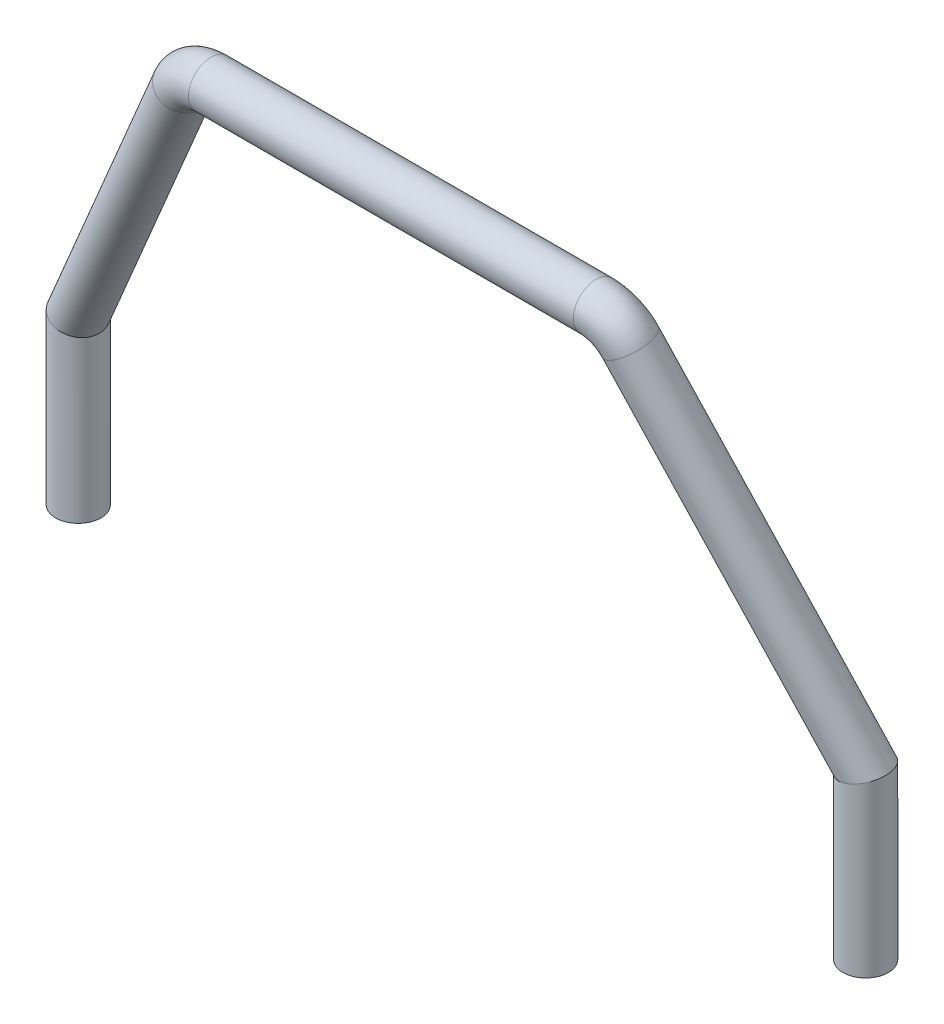
ISO-10303-21;
HEADER;
FILE_DESCRIPTION(('STEP AP214'),'2;1');
FILE_NAME('part.step','',(''),(''),'','','');
FILE_SCHEMA(('AUTOMOTIVE_DESIGN { 1 0 10303 214 1 1 1 1 }'));
ENDSEC;
DATA;
#1=APPLICATION_CONTEXT('core data for automotive mechanical design processes');
#2=APPLICATION_PROTOCOL_DEFINITION('international standard','automotive_design',2000,#1);
#3=PRODUCT_CONTEXT('',#1,'mechanical');
#4=PRODUCT('Part','Part','',(#3));
#5=PRODUCT_RELATED_PRODUCT_CATEGORY('part','',(#4));
#6=PRODUCT_DEFINITION_FORMATION('','',#4);
#7=PRODUCT_DEFINITION_CONTEXT('part definition',#1,'design');
#8=PRODUCT_DEFINITION('design','',#6,#7);
#9=PRODUCT_DEFINITION_SHAPE('','',#8);
#10=(LENGTH_UNIT() NAMED_UNIT(*) SI_UNIT(.MILLI.,.METRE.));
#11=(NAMED_UNIT(*) PLANE_ANGLE_UNIT() SI_UNIT($,.RADIAN.));
#12=(NAMED_UNIT(*) SI_UNIT($,.STERADIAN.) SOLID_ANGLE_UNIT());
#13=UNCERTAINTY_MEASURE_WITH_UNIT(LENGTH_MEASURE(1.E-05),#10,'distance_accuracy_value','');
#14=(GEOMETRIC_REPRESENTATION_CONTEXT(3) GLOBAL_UNCERTAINTY_ASSIGNED_CONTEXT((#13)) GLOBAL_UNIT_ASSIGNED_CONTEXT((#10,
#11,#12)) REPRESENTATION_CONTEXT('',''));
#15=CARTESIAN_POINT('',(0.,0.,0.));
#16=DIRECTION('',(0.,0.,1.));
#17=DIRECTION('',(1.,0.,0.));
#18=AXIS2_PLACEMENT_3D('',#15,#16,#17);
#19=CARTESIAN_POINT('',(-56.4,0.,0.));
#20=DIRECTION('',(0.,1.,0.));
#21=DIRECTION('',(0.,0.,1.));
#22=AXIS2_PLACEMENT_3D('',#19,#20,#21);
#23=PLANE('',#22);
#24=CARTESIAN_POINT('',(-56.4,0.,0.));
#25=DIRECTION('',(0.,1.,0.));
#26=DIRECTION('',(0.,0.,1.));
#27=AXIS2_PLACEMENT_3D('',#24,#25,#26);
#28=CIRCLE('',#27,3.25);
#29=CARTESIAN_POINT('',(-56.4,0.,3.25));
#30=VERTEX_POINT('',#29);
#31=EDGE_CURVE('E47',#30,#30,#28,.T.);
#32=ORIENTED_EDGE('',*,*,#31,.F.);
#33=EDGE_LOOP('',(#32));
#34=FACE_BOUND('',#33,.T.);
#35=ADVANCED_FACE('F39',(#34),#23,.F.);
#36=CARTESIAN_POINT('',(-57.4456053734697,21.9236442987068,-0.397287657122819));
#37=DIRECTION('',(0.467987523538528,0.865661045295232,0.177816288541409));
#38=DIRECTION('',(-0.879679887042542,0.475566290156084,0.));
#39=AXIS2_PLACEMENT_3D('',#36,#37,#38);
#40=CYLINDRICAL_SURFACE('',#39,3.25);
#41=CARTESIAN_POINT('',(-56.4,23.8577553487625,0.));
#42=DIRECTION('',(0.242271821971086,0.965831518768991,0.0920534715868698));
#43=DIRECTION('',(-0.902855597313143,0.259170749415099,-0.343048528706862));
#44=AXIS2_PLACEMENT_3D('',#41,#42,#43);
#45=ELLIPSE('',#44,3.36497612351926,3.25);
#46=CARTESIAN_POINT('',(-59.4380875279444,24.7298587324589,-1.154350108307));
#47=VERTEX_POINT('',#46);
#48=EDGE_CURVE('E11',#47,#47,#45,.F.);
#49=ORIENTED_EDGE('',*,*,#48,.F.);
#50=EDGE_LOOP('',(#49));
#51=FACE_BOUND('',#50,.T.);
#52=CARTESIAN_POINT('',(-31.9910274231508,69.0083109783045,9.2744201339099));
#53=DIRECTION('',(0.467987523538528,0.865661045295232,0.177816288541409));
#54=DIRECTION('',(-0.044603924560229,-0.177816288541409,0.983052316737611));
#55=AXIS2_PLACEMENT_3D('',#52,#53,#54);
#56=CIRCLE('',#55,3.25);
#57=CARTESIAN_POINT('',(-34.8631664077566,70.4981639784576,9.58045230712516));
#58=VERTEX_POINT('',#57);
#59=EDGE_CURVE('E42',#58,#58,#56,.T.);
#60=ORIENTED_EDGE('',*,*,#59,.F.);
#61=EDGE_LOOP('',(#60));
#62=FACE_BOUND('',#61,.T.);
#63=ADVANCED_FACE('F86',(#51,#62),#40,.T.);
#64=CARTESIAN_POINT('',(-27.5723520622189,66.7162294396075,8.80360140588642));
#65=DIRECTION('',(0.,0.20120994870271,-0.979548138961559));
#66=DIRECTION('',(0.,0.979548138961559,0.20120994870271));
#67=AXIS2_PLACEMENT_3D('',#64,#65,#66);
#68=TOROIDAL_SURFACE('',#67,5.00000000000001,3.25);
#69=CARTESIAN_POINT('',(-27.5723520622189,71.6139701344153,9.80965114939997));
#70=DIRECTION('',(1.,0.,0.));
#71=DIRECTION('',(0.,-0.151513694452595,0.988455158514197));
#72=AXIS2_PLACEMENT_3D('',#69,#70,#71);
#73=CIRCLE('',#72,3.25);
#74=CARTESIAN_POINT('',(-27.5723520622189,74.7975015860404,10.4635834826838));
#75=VERTEX_POINT('',#74);
#76=EDGE_CURVE('E67',#75,#75,#73,.T.);
#77=CARTESIAN_POINT('',(-27.5723520622189,66.7162294396075,8.80360140588642));
#78=DIRECTION('',(0.,0.20120994870271,-0.979548138961559));
#79=DIRECTION('',(0.,0.979548138961559,0.20120994870271));
#80=AXIS2_PLACEMENT_3D('',#77,#78,#79);
#81=CIRCLE('',#80,8.25000000000001);
#82=EDGE_CURVE('',#58,#75,#81,.T.);
#83=ORIENTED_EDGE('',*,*,#59,.T.);
#84=ORIENTED_EDGE('',*,*,#76,.F.);
#85=ORIENTED_EDGE('',*,*,#82,.T.);
#86=ORIENTED_EDGE('',*,*,#82,.F.);
#87=EDGE_LOOP('',(#83,#85,#84,#86));
#88=FACE_BOUND('',#87,.T.);
#89=ADVANCED_FACE('F84',(#88),#68,.T.);
#90=CARTESIAN_POINT('',(-27.5723520622189,71.6139701344153,9.80965114939998));
#91=DIRECTION('',(1.,0.,0.));
#92=DIRECTION('',(0.,0.,-1.));
#93=AXIS2_PLACEMENT_3D('',#90,#91,#92);
#94=CYLINDRICAL_SURFACE('',#93,3.25);
#95=ORIENTED_EDGE('',*,*,#76,.T.);
#96=EDGE_LOOP('',(#95));
#97=FACE_BOUND('',#96,.T.);
#98=CARTESIAN_POINT('',(27.5723520622189,71.6139701344153,9.80965114939997));
#99=DIRECTION('',(1.,0.,0.));
#100=DIRECTION('',(0.,-0.151513694452595,0.988455158514196));
#101=AXIS2_PLACEMENT_3D('',#98,#99,#100);
#102=CIRCLE('',#101,3.25);
#103=CARTESIAN_POINT('',(27.5723520622189,74.7975015860404,10.4635834826838));
#104=VERTEX_POINT('',#103);
#105=EDGE_CURVE('E75',#104,#104,#102,.F.);
#106=ORIENTED_EDGE('',*,*,#105,.T.);
#107=EDGE_LOOP('',(#106));
#108=FACE_BOUND('',#107,.T.);
#109=ADVANCED_FACE('F92',(#97,#108),#94,.T.);
#110=CARTESIAN_POINT('',(-56.4,0.,0.));
#111=DIRECTION('',(0.,1.,0.));
#112=DIRECTION('',(0.,0.,1.));
#113=AXIS2_PLACEMENT_3D('',#110,#111,#112);
#114=CYLINDRICAL_SURFACE('',#113,3.25);
#115=ORIENTED_EDGE('',*,*,#31,.T.);
#116=EDGE_LOOP('',(#115));
#117=FACE_BOUND('',#116,.T.);
#118=ORIENTED_EDGE('',*,*,#48,.T.);
#119=EDGE_LOOP('',(#118));
#120=FACE_BOUND('',#119,.T.);
#121=ADVANCED_FACE('F96',(#117,#120),#114,.T.);
#122=CARTESIAN_POINT('',(56.4,0.,0.));
#123=DIRECTION('',(0.,1.,0.));
#124=DIRECTION('',(0.,0.,1.));
#125=AXIS2_PLACEMENT_3D('',#122,#123,#124);
#126=PLANE('',#125);
#127=CARTESIAN_POINT('',(56.4,0.,0.));
#128=DIRECTION('',(0.,-1.,0.));
#129=DIRECTION('',(0.,0.,1.));
#130=AXIS2_PLACEMENT_3D('',#127,#128,#129);
#131=CIRCLE('',#130,3.25);
#132=CARTESIAN_POINT('',(56.4,0.,3.24999999999999));
#133=VERTEX_POINT('',#132);
#134=EDGE_CURVE('E68',#133,#133,#131,.F.);
#135=ORIENTED_EDGE('',*,*,#134,.F.);
#136=EDGE_LOOP('',(#135));
#137=FACE_BOUND('',#136,.T.);
#138=ADVANCED_FACE('F98',(#137),#126,.F.);
#139=CARTESIAN_POINT('',(57.4456053734697,21.9236442987068,-0.397287657122835));
#140=DIRECTION('',(-0.467987523538528,0.865661045295232,0.177816288541409));
#141=DIRECTION('',(-0.879679887042542,-0.475566290156084,0.));
#142=AXIS2_PLACEMENT_3D('',#139,#140,#141);
#143=CYLINDRICAL_SURFACE('',#142,3.25);
#144=CARTESIAN_POINT('',(56.4,23.8577553487625,0.));
#145=DIRECTION('',(-0.242271821971085,0.965831518768991,0.0920534715868698));
#146=DIRECTION('',(0.902855597313143,0.259170749415099,-0.343048528706863));
#147=AXIS2_PLACEMENT_3D('',#144,#145,#146);
#148=ELLIPSE('',#147,3.36497612351926,3.25);
#149=CARTESIAN_POINT('',(59.4380875279444,24.7298587324589,-1.15435010830702));
#150=VERTEX_POINT('',#149);
#151=EDGE_CURVE('E63',#150,#150,#148,.F.);
#152=ORIENTED_EDGE('',*,*,#151,.F.);
#153=EDGE_LOOP('',(#152));
#154=FACE_BOUND('',#153,.T.);
#155=CARTESIAN_POINT('',(31.9910274231508,69.0083109783045,9.27442013390989));
#156=DIRECTION('',(0.467987523538528,-0.865661045295232,-0.177816288541409));
#157=DIRECTION('',(0.0446039245602292,-0.177816288541409,0.983052316737611));
#158=AXIS2_PLACEMENT_3D('',#155,#156,#157);
#159=CIRCLE('',#158,3.25);
#160=CARTESIAN_POINT('',(34.8631664077566,70.4981639784576,9.58045230712515));
#161=VERTEX_POINT('',#160);
#162=EDGE_CURVE('E72',#161,#161,#159,.F.);
#163=ORIENTED_EDGE('',*,*,#162,.F.);
#164=EDGE_LOOP('',(#163));
#165=FACE_BOUND('',#164,.T.);
#166=ADVANCED_FACE('F64',(#154,#165),#143,.T.);
#167=CARTESIAN_POINT('',(27.5723520622189,66.7162294396075,8.80360140588641));
#168=DIRECTION('',(0.,-0.20120994870271,0.979548138961559));
#169=DIRECTION('',(0.,-0.979548138961559,-0.20120994870271));
#170=AXIS2_PLACEMENT_3D('',#167,#168,#169);
#171=TOROIDAL_SURFACE('',#170,5.00000000000002,3.25);
#172=CARTESIAN_POINT('',(27.5723520622189,66.7162294396075,8.80360140588641));
#173=DIRECTION('',(0.,-0.20120994870271,0.979548138961559));
#174=DIRECTION('',(0.,-0.979548138961559,-0.20120994870271));
#175=AXIS2_PLACEMENT_3D('',#172,#173,#174);
#176=CIRCLE('',#175,8.25000000000002);
#177=EDGE_CURVE('',#161,#104,#176,.T.);
#178=ORIENTED_EDGE('',*,*,#162,.T.);
#179=ORIENTED_EDGE('',*,*,#105,.F.);
#180=ORIENTED_EDGE('',*,*,#177,.T.);
#181=ORIENTED_EDGE('',*,*,#177,.F.);
#182=EDGE_LOOP('',(#178,#180,#179,#181));
#183=FACE_BOUND('',#182,.T.);
#184=ADVANCED_FACE('F112',(#183),#171,.T.);
#185=CARTESIAN_POINT('',(56.4,0.,0.));
#186=DIRECTION('',(0.,1.,0.));
#187=DIRECTION('',(-1.,0.,0.));
#188=AXIS2_PLACEMENT_3D('',#185,#186,#187);
#189=CYLINDRICAL_SURFACE('',#188,3.25);
#190=ORIENTED_EDGE('',*,*,#134,.T.);
#191=EDGE_LOOP('',(#190));
#192=FACE_BOUND('',#191,.T.);
#193=ORIENTED_EDGE('',*,*,#151,.T.);
#194=EDGE_LOOP('',(#193));
#195=FACE_BOUND('',#194,.T.);
#196=ADVANCED_FACE('F95',(#192,#195),#189,.T.);
#197=CLOSED_SHELL('',(#35,#63,#89,#109,#121,#138,#166,#184,#196));
#198=MANIFOLD_SOLID_BREP('B2',#197);
#199=ADVANCED_BREP_SHAPE_REPRESENTATION('',(#18,#198),#14);
#200=SHAPE_DEFINITION_REPRESENTATION(#9,#199);
ENDSEC;
END-ISO-10303-21;
